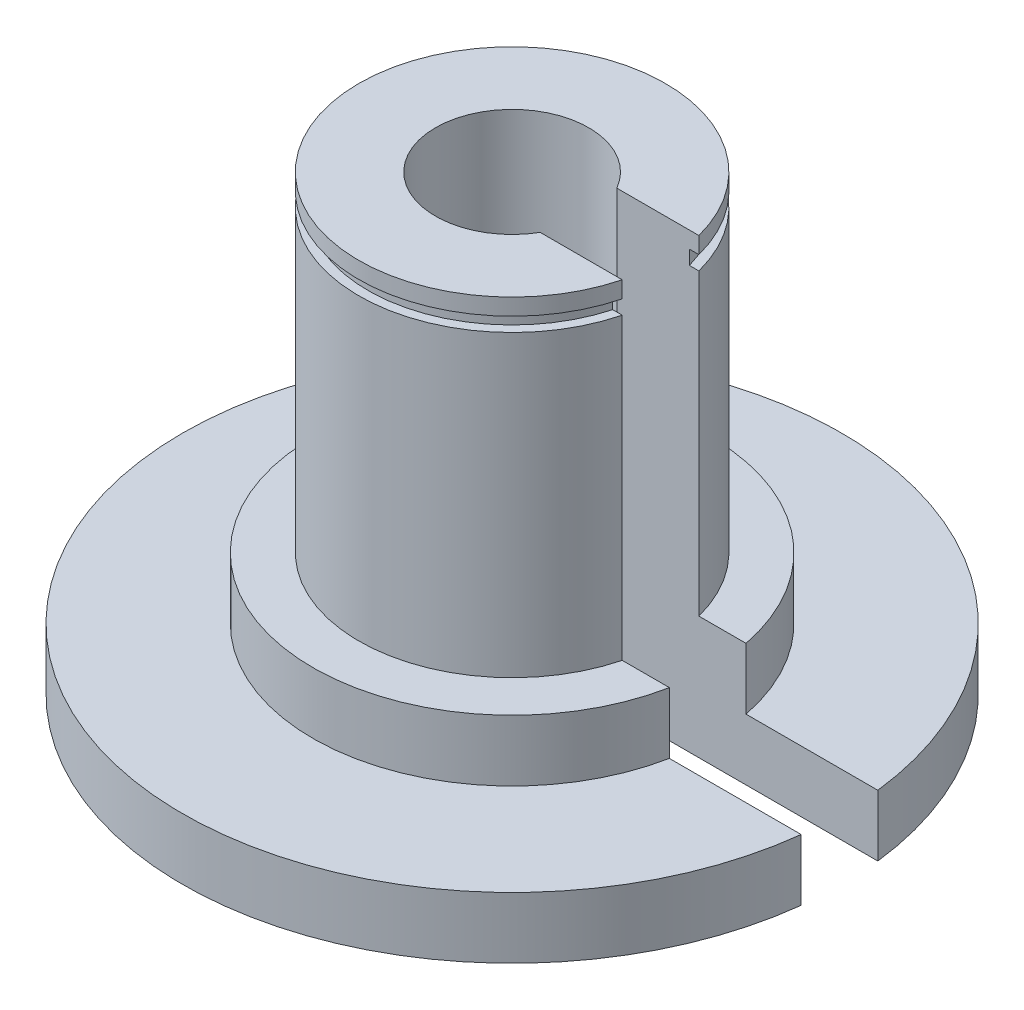
ISO-10303-21;
HEADER;
FILE_DESCRIPTION(('STEP AP214'),'2;1');
FILE_NAME('part.step','',(''),(''),'','','');
FILE_SCHEMA(('AUTOMOTIVE_DESIGN { 1 0 10303 214 1 1 1 1 }'));
ENDSEC;
DATA;
#1=APPLICATION_CONTEXT('core data for automotive mechanical design processes');
#2=APPLICATION_PROTOCOL_DEFINITION('international standard','automotive_design',2000,#1);
#3=PRODUCT_CONTEXT('',#1,'mechanical');
#4=PRODUCT('Part','Part','',(#3));
#5=PRODUCT_RELATED_PRODUCT_CATEGORY('part','',(#4));
#6=PRODUCT_DEFINITION_FORMATION('','',#4);
#7=PRODUCT_DEFINITION_CONTEXT('part definition',#1,'design');
#8=PRODUCT_DEFINITION('design','',#6,#7);
#9=PRODUCT_DEFINITION_SHAPE('','',#8);
#10=(LENGTH_UNIT() NAMED_UNIT(*) SI_UNIT(.MILLI.,.METRE.));
#11=(NAMED_UNIT(*) PLANE_ANGLE_UNIT() SI_UNIT($,.RADIAN.));
#12=(NAMED_UNIT(*) SI_UNIT($,.STERADIAN.) SOLID_ANGLE_UNIT());
#13=UNCERTAINTY_MEASURE_WITH_UNIT(LENGTH_MEASURE(1.E-05),#10,'distance_accuracy_value','');
#14=(GEOMETRIC_REPRESENTATION_CONTEXT(3) GLOBAL_UNCERTAINTY_ASSIGNED_CONTEXT((#13)) GLOBAL_UNIT_ASSIGNED_CONTEXT((#10,
#11,#12)) REPRESENTATION_CONTEXT('',''));
#15=CARTESIAN_POINT('',(0.,0.,0.));
#16=DIRECTION('',(0.,0.,1.));
#17=DIRECTION('',(1.,0.,0.));
#18=AXIS2_PLACEMENT_3D('',#15,#16,#17);
#19=CARTESIAN_POINT('',(0.,50.8,0.));
#20=DIRECTION('',(0.,-1.,0.));
#21=DIRECTION('',(0.,0.,-1.));
#22=AXIS2_PLACEMENT_3D('',#19,#20,#21);
#23=CYLINDRICAL_SURFACE('',#22,27.305);
#24=CARTESIAN_POINT('',(0.,5.08,0.));
#25=DIRECTION('',(0.,1.,0.));
#26=DIRECTION('',(0.,0.,1.));
#27=AXIS2_PLACEMENT_3D('',#24,#25,#26);
#28=CIRCLE('',#27,27.305);
#29=CARTESIAN_POINT('',(27.1197787601595,5.08,-3.175));
#30=VERTEX_POINT('',#29);
#31=CARTESIAN_POINT('',(27.1197787601595,5.08,3.175));
#32=VERTEX_POINT('',#31);
#33=EDGE_CURVE('E256',#30,#32,#28,.T.);
#34=ORIENTED_EDGE('',*,*,#33,.F.);
#35=DIRECTION('',(0.,-1.,0.));
#36=VECTOR('',#35,1.);
#37=CARTESIAN_POINT('',(27.1197787601595,50.8,-3.175));
#38=LINE('',#37,#36);
#39=CARTESIAN_POINT('',(27.1197787601595,0.,-3.175));
#40=VERTEX_POINT('',#39);
#41=EDGE_CURVE('E188',#30,#40,#38,.T.);
#42=ORIENTED_EDGE('',*,*,#41,.T.);
#43=CARTESIAN_POINT('',(0.,0.,0.));
#44=DIRECTION('',(0.,1.,0.));
#45=DIRECTION('',(0.,0.,1.));
#46=AXIS2_PLACEMENT_3D('',#43,#44,#45);
#47=CIRCLE('',#46,27.305);
#48=CARTESIAN_POINT('',(27.1197787601595,0.,3.175));
#49=VERTEX_POINT('',#48);
#50=EDGE_CURVE('E200',#40,#49,#47,.T.);
#51=ORIENTED_EDGE('',*,*,#50,.T.);
#52=DIRECTION('',(0.,-1.,0.));
#53=VECTOR('',#52,1.);
#54=CARTESIAN_POINT('',(27.1197787601595,50.8,3.175));
#55=LINE('',#54,#53);
#56=EDGE_CURVE('E192',#49,#32,#55,.F.);
#57=ORIENTED_EDGE('',*,*,#56,.T.);
#58=EDGE_LOOP('',(#34,#42,#51,#57));
#59=FACE_BOUND('',#58,.T.);
#60=ADVANCED_FACE('F37',(#59),#23,.T.);
#61=CARTESIAN_POINT('',(2.49980958537012,6.35,3.175));
#62=DIRECTION('',(0.,0.,1.));
#63=DIRECTION('',(1.,0.,0.));
#64=AXIS2_PLACEMENT_3D('',#61,#62,#63);
#65=PLANE('',#64);
#66=DIRECTION('',(-1.,0.,0.));
#67=VECTOR('',#66,1.);
#68=CARTESIAN_POINT('',(2.49980958537012,5.08,3.175));
#69=LINE('',#68,#67);
#70=CARTESIAN_POINT('',(16.2018355441598,5.08,3.175));
#71=VERTEX_POINT('',#70);
#72=EDGE_CURVE('E257',#32,#71,#69,.T.);
#73=ORIENTED_EDGE('',*,*,#72,.F.);
#74=ORIENTED_EDGE('',*,*,#56,.F.);
#75=DIRECTION('',(-1.,0.,0.));
#76=VECTOR('',#75,1.);
#77=CARTESIAN_POINT('',(2.49980958537012,0.,3.175));
#78=LINE('',#77,#76);
#79=CARTESIAN_POINT('',(3.25437345121914,0.,3.175));
#80=VERTEX_POINT('',#79);
#81=EDGE_CURVE('E59',#49,#80,#78,.T.);
#82=ORIENTED_EDGE('',*,*,#81,.T.);
#83=DIRECTION('',(0.,-1.,0.));
#84=VECTOR('',#83,1.);
#85=CARTESIAN_POINT('',(3.25437345121914,50.8,3.175));
#86=LINE('',#85,#84);
#87=CARTESIAN_POINT('',(3.25437345121914,6.35,3.175));
#88=VERTEX_POINT('',#87);
#89=EDGE_CURVE('E190',#80,#88,#86,.F.);
#90=ORIENTED_EDGE('',*,*,#89,.T.);
#91=DIRECTION('',(-1.,0.,0.));
#92=VECTOR('',#91,1.);
#93=CARTESIAN_POINT('',(2.49980958537012,6.35,3.175));
#94=LINE('',#93,#92);
#95=CARTESIAN_POINT('',(5.49926131403118,6.35,3.175));
#96=VERTEX_POINT('',#95);
#97=EDGE_CURVE('E178',#96,#88,#94,.T.);
#98=ORIENTED_EDGE('',*,*,#97,.F.);
#99=DIRECTION('',(0.,1.,0.));
#100=VECTOR('',#99,1.);
#101=CARTESIAN_POINT('',(5.49926131403119,6.35,3.175));
#102=LINE('',#101,#100);
#103=CARTESIAN_POINT('',(5.49926131403119,37.465,3.175));
#104=VERTEX_POINT('',#103);
#105=EDGE_CURVE('E249',#104,#96,#102,.F.);
#106=ORIENTED_EDGE('',*,*,#105,.F.);
#107=DIRECTION('',(-1.,0.,0.));
#108=VECTOR('',#107,1.);
#109=CARTESIAN_POINT('',(2.49980958537012,37.465,3.175));
#110=LINE('',#109,#108);
#111=CARTESIAN_POINT('',(12.2967221242085,37.465,3.175));
#112=VERTEX_POINT('',#111);
#113=EDGE_CURVE('E149',#112,#104,#110,.T.);
#114=ORIENTED_EDGE('',*,*,#113,.F.);
#115=DIRECTION('',(0.,1.,0.));
#116=VECTOR('',#115,1.);
#117=CARTESIAN_POINT('',(12.2967221242085,6.35,3.175));
#118=LINE('',#117,#116);
#119=CARTESIAN_POINT('',(12.2967221242085,36.0934,3.175));
#120=VERTEX_POINT('',#119);
#121=EDGE_CURVE('E247',#112,#120,#118,.F.);
#122=ORIENTED_EDGE('',*,*,#121,.T.);
#123=DIRECTION('',(1.,0.,0.));
#124=VECTOR('',#123,1.);
#125=CARTESIAN_POINT('',(-0.0926106199202349,36.0934,3.175));
#126=LINE('',#125,#124);
#127=CARTESIAN_POINT('',(11.5080501823723,36.0934,3.175));
#128=VERTEX_POINT('',#127);
#129=EDGE_CURVE('E244',#128,#120,#126,.T.);
#130=ORIENTED_EDGE('',*,*,#129,.F.);
#131=DIRECTION('',(0.,-1.,0.));
#132=VECTOR('',#131,1.);
#133=CARTESIAN_POINT('',(11.5080501823723,36.0934,3.175));
#134=LINE('',#133,#132);
#135=CARTESIAN_POINT('',(11.5080501823723,34.925,3.175));
#136=VERTEX_POINT('',#135);
#137=EDGE_CURVE('E241',#136,#128,#134,.F.);
#138=ORIENTED_EDGE('',*,*,#137,.F.);
#139=DIRECTION('',(1.,0.,0.));
#140=VECTOR('',#139,1.);
#141=CARTESIAN_POINT('',(-0.0926106199202349,34.925,3.175));
#142=LINE('',#141,#140);
#143=CARTESIAN_POINT('',(12.2967221242085,34.925,3.175));
#144=VERTEX_POINT('',#143);
#145=EDGE_CURVE('E239',#136,#144,#142,.T.);
#146=ORIENTED_EDGE('',*,*,#145,.T.);
#147=DIRECTION('',(0.,1.,0.));
#148=VECTOR('',#147,1.);
#149=CARTESIAN_POINT('',(12.2967221242085,6.35,3.175));
#150=LINE('',#149,#148);
#151=CARTESIAN_POINT('',(12.2967221242085,10.16,3.175));
#152=VERTEX_POINT('',#151);
#153=EDGE_CURVE('E220',#144,#152,#150,.F.);
#154=ORIENTED_EDGE('',*,*,#153,.T.);
#155=DIRECTION('',(1.,0.,0.));
#156=VECTOR('',#155,1.);
#157=CARTESIAN_POINT('',(0.,10.16,3.175));
#158=LINE('',#157,#156);
#159=CARTESIAN_POINT('',(16.2018355441598,10.16,3.175));
#160=VERTEX_POINT('',#159);
#161=EDGE_CURVE('E158',#152,#160,#158,.T.);
#162=ORIENTED_EDGE('',*,*,#161,.T.);
#163=DIRECTION('',(0.,1.,0.));
#164=VECTOR('',#163,1.);
#165=CARTESIAN_POINT('',(16.2018355441598,5.08,3.175));
#166=LINE('',#165,#164);
#167=EDGE_CURVE('E51',#71,#160,#166,.T.);
#168=ORIENTED_EDGE('',*,*,#167,.F.);
#169=EDGE_LOOP('',(#73,#74,#82,#90,#98,#106,#114,#122,#130,#138,#146,#154,#162,#168));
#170=FACE_BOUND('',#169,.T.);
#171=ADVANCED_FACE('F268',(#170),#65,.F.);
#172=CARTESIAN_POINT('',(2.49980958537012,6.35,-3.175));
#173=DIRECTION('',(0.,0.,-1.));
#174=DIRECTION('',(-1.,0.,0.));
#175=AXIS2_PLACEMENT_3D('',#172,#173,#174);
#176=PLANE('',#175);
#177=DIRECTION('',(1.,0.,0.));
#178=VECTOR('',#177,1.);
#179=CARTESIAN_POINT('',(2.49980958537012,5.08,-3.175));
#180=LINE('',#179,#178);
#181=CARTESIAN_POINT('',(16.2018355441598,5.08,-3.175));
#182=VERTEX_POINT('',#181);
#183=EDGE_CURVE('E12',#182,#30,#180,.T.);
#184=ORIENTED_EDGE('',*,*,#183,.F.);
#185=DIRECTION('',(0.,1.,0.));
#186=VECTOR('',#185,1.);
#187=CARTESIAN_POINT('',(16.2018355441598,5.08,-3.175));
#188=LINE('',#187,#186);
#189=CARTESIAN_POINT('',(16.2018355441598,10.16,-3.175));
#190=VERTEX_POINT('',#189);
#191=EDGE_CURVE('E253',#190,#182,#188,.F.);
#192=ORIENTED_EDGE('',*,*,#191,.F.);
#193=DIRECTION('',(-1.,0.,0.));
#194=VECTOR('',#193,1.);
#195=CARTESIAN_POINT('',(0.,10.16,-3.175));
#196=LINE('',#195,#194);
#197=CARTESIAN_POINT('',(12.2967221242085,10.16,-3.175));
#198=VERTEX_POINT('',#197);
#199=EDGE_CURVE('E215',#190,#198,#196,.T.);
#200=ORIENTED_EDGE('',*,*,#199,.T.);
#201=DIRECTION('',(0.,1.,0.));
#202=VECTOR('',#201,1.);
#203=CARTESIAN_POINT('',(12.2967221242085,6.35,-3.175));
#204=LINE('',#203,#202);
#205=CARTESIAN_POINT('',(12.2967221242085,34.925,-3.175));
#206=VERTEX_POINT('',#205);
#207=EDGE_CURVE('E222',#198,#206,#204,.T.);
#208=ORIENTED_EDGE('',*,*,#207,.T.);
#209=DIRECTION('',(-1.,0.,0.));
#210=VECTOR('',#209,1.);
#211=CARTESIAN_POINT('',(-0.0926106199202349,34.925,-3.175));
#212=LINE('',#211,#210);
#213=CARTESIAN_POINT('',(11.5080501823723,34.925,-3.175));
#214=VERTEX_POINT('',#213);
#215=EDGE_CURVE('E224',#206,#214,#212,.T.);
#216=ORIENTED_EDGE('',*,*,#215,.T.);
#217=DIRECTION('',(0.,-1.,0.));
#218=VECTOR('',#217,1.);
#219=CARTESIAN_POINT('',(11.5080501823723,36.0934,-3.175));
#220=LINE('',#219,#218);
#221=CARTESIAN_POINT('',(11.5080501823723,36.0934,-3.175));
#222=VERTEX_POINT('',#221);
#223=EDGE_CURVE('E226',#222,#214,#220,.T.);
#224=ORIENTED_EDGE('',*,*,#223,.F.);
#225=DIRECTION('',(-1.,0.,0.));
#226=VECTOR('',#225,1.);
#227=CARTESIAN_POINT('',(-0.0926106199202349,36.0934,-3.175));
#228=LINE('',#227,#226);
#229=CARTESIAN_POINT('',(12.2967221242085,36.0934,-3.175));
#230=VERTEX_POINT('',#229);
#231=EDGE_CURVE('E233',#230,#222,#228,.T.);
#232=ORIENTED_EDGE('',*,*,#231,.F.);
#233=DIRECTION('',(0.,1.,0.));
#234=VECTOR('',#233,1.);
#235=CARTESIAN_POINT('',(12.2967221242085,6.35,-3.175));
#236=LINE('',#235,#234);
#237=CARTESIAN_POINT('',(12.2967221242085,37.465,-3.175));
#238=VERTEX_POINT('',#237);
#239=EDGE_CURVE('E144',#230,#238,#236,.T.);
#240=ORIENTED_EDGE('',*,*,#239,.T.);
#241=DIRECTION('',(1.,0.,0.));
#242=VECTOR('',#241,1.);
#243=CARTESIAN_POINT('',(2.49980958537012,37.465,-3.175));
#244=LINE('',#243,#242);
#245=CARTESIAN_POINT('',(5.49926131403118,37.465,-3.175));
#246=VERTEX_POINT('',#245);
#247=EDGE_CURVE('E137',#246,#238,#244,.T.);
#248=ORIENTED_EDGE('',*,*,#247,.F.);
#249=DIRECTION('',(0.,1.,0.));
#250=VECTOR('',#249,1.);
#251=CARTESIAN_POINT('',(5.49926131403118,6.35,-3.175));
#252=LINE('',#251,#250);
#253=CARTESIAN_POINT('',(5.49926131403118,6.35,-3.175));
#254=VERTEX_POINT('',#253);
#255=EDGE_CURVE('E141',#254,#246,#252,.T.);
#256=ORIENTED_EDGE('',*,*,#255,.F.);
#257=DIRECTION('',(1.,0.,0.));
#258=VECTOR('',#257,1.);
#259=CARTESIAN_POINT('',(2.49980958537012,6.35,-3.175));
#260=LINE('',#259,#258);
#261=CARTESIAN_POINT('',(3.25437345121914,6.35,-3.175));
#262=VERTEX_POINT('',#261);
#263=EDGE_CURVE('E176',#262,#254,#260,.T.);
#264=ORIENTED_EDGE('',*,*,#263,.F.);
#265=DIRECTION('',(0.,-1.,0.));
#266=VECTOR('',#265,1.);
#267=CARTESIAN_POINT('',(3.25437345121914,50.8,-3.175));
#268=LINE('',#267,#266);
#269=CARTESIAN_POINT('',(3.25437345121914,0.,-3.175));
#270=VERTEX_POINT('',#269);
#271=EDGE_CURVE('E181',#262,#270,#268,.T.);
#272=ORIENTED_EDGE('',*,*,#271,.T.);
#273=DIRECTION('',(1.,0.,0.));
#274=VECTOR('',#273,1.);
#275=CARTESIAN_POINT('',(2.49980958537012,0.,-3.175));
#276=LINE('',#275,#274);
#277=EDGE_CURVE('E182',#270,#40,#276,.T.);
#278=ORIENTED_EDGE('',*,*,#277,.T.);
#279=ORIENTED_EDGE('',*,*,#41,.F.);
#280=EDGE_LOOP('',(#184,#192,#200,#208,#216,#224,#232,#240,#248,#256,#264,#272,#278,#279));
#281=FACE_BOUND('',#280,.T.);
#282=ADVANCED_FACE('F140',(#281),#176,.F.);
#283=CARTESIAN_POINT('',(0.,6.35,0.));
#284=DIRECTION('',(0.,1.,0.));
#285=DIRECTION('',(0.,0.,1.));
#286=AXIS2_PLACEMENT_3D('',#283,#284,#285);
#287=CYLINDRICAL_SURFACE('',#286,6.35);
#288=CARTESIAN_POINT('',(0.,37.465,0.));
#289=DIRECTION('',(0.,1.,0.));
#290=DIRECTION('',(0.,0.,1.));
#291=AXIS2_PLACEMENT_3D('',#288,#289,#290);
#292=CIRCLE('',#291,6.35);
#293=EDGE_CURVE('E155',#104,#246,#292,.F.);
#294=ORIENTED_EDGE('',*,*,#293,.F.);
#295=ORIENTED_EDGE('',*,*,#105,.T.);
#296=CARTESIAN_POINT('',(0.,6.35,0.));
#297=DIRECTION('',(0.,1.,0.));
#298=DIRECTION('',(0.,0.,1.));
#299=AXIS2_PLACEMENT_3D('',#296,#297,#298);
#300=CIRCLE('',#299,6.35);
#301=EDGE_CURVE('E157',#254,#96,#300,.T.);
#302=ORIENTED_EDGE('',*,*,#301,.F.);
#303=ORIENTED_EDGE('',*,*,#255,.T.);
#304=EDGE_LOOP('',(#294,#295,#302,#303));
#305=FACE_BOUND('',#304,.T.);
#306=ADVANCED_FACE('F154',(#305),#287,.F.);
#307=CARTESIAN_POINT('',(0.,6.35,0.));
#308=DIRECTION('',(0.,1.,0.));
#309=DIRECTION('',(0.,0.,1.));
#310=AXIS2_PLACEMENT_3D('',#307,#308,#309);
#311=CYLINDRICAL_SURFACE('',#310,12.7);
#312=ORIENTED_EDGE('',*,*,#121,.F.);
#313=CARTESIAN_POINT('',(0.,37.465,0.));
#314=DIRECTION('',(0.,1.,0.));
#315=DIRECTION('',(0.,0.,1.));
#316=AXIS2_PLACEMENT_3D('',#313,#314,#315);
#317=CIRCLE('',#316,12.7);
#318=EDGE_CURVE('E163',#112,#238,#317,.F.);
#319=ORIENTED_EDGE('',*,*,#318,.T.);
#320=ORIENTED_EDGE('',*,*,#239,.F.);
#321=CARTESIAN_POINT('',(0.,36.0934,0.));
#322=DIRECTION('',(0.,1.,0.));
#323=DIRECTION('',(0.,0.,1.));
#324=AXIS2_PLACEMENT_3D('',#321,#322,#323);
#325=CIRCLE('',#324,12.7);
#326=EDGE_CURVE('E185',#120,#230,#325,.F.);
#327=ORIENTED_EDGE('',*,*,#326,.F.);
#328=EDGE_LOOP('',(#312,#319,#320,#327));
#329=FACE_BOUND('',#328,.T.);
#330=ADVANCED_FACE('F281',(#329),#311,.T.);
#331=ORIENTED_EDGE('',*,*,#153,.F.);
#332=CARTESIAN_POINT('',(0.,34.925,0.));
#333=DIRECTION('',(0.,1.,0.));
#334=DIRECTION('',(0.,0.,1.));
#335=AXIS2_PLACEMENT_3D('',#332,#333,#334);
#336=CIRCLE('',#335,12.7);
#337=EDGE_CURVE('E174',#144,#206,#336,.F.);
#338=ORIENTED_EDGE('',*,*,#337,.T.);
#339=ORIENTED_EDGE('',*,*,#207,.F.);
#340=CARTESIAN_POINT('',(0.,10.16,0.));
#341=DIRECTION('',(0.,1.,0.));
#342=DIRECTION('',(0.,0.,1.));
#343=AXIS2_PLACEMENT_3D('',#340,#341,#342);
#344=CIRCLE('',#343,12.7);
#345=EDGE_CURVE('E44',#152,#198,#344,.F.);
#346=ORIENTED_EDGE('',*,*,#345,.F.);
#347=EDGE_LOOP('',(#331,#338,#339,#346));
#348=FACE_BOUND('',#347,.T.);
#349=ADVANCED_FACE('F219',(#348),#311,.T.);
#350=CARTESIAN_POINT('',(0.,50.8,0.));
#351=DIRECTION('',(0.,-1.,0.));
#352=DIRECTION('',(0.,0.,-1.));
#353=AXIS2_PLACEMENT_3D('',#350,#351,#352);
#354=CYLINDRICAL_SURFACE('',#353,4.5466);
#355=ORIENTED_EDGE('',*,*,#89,.F.);
#356=CARTESIAN_POINT('',(0.,0.,0.));
#357=DIRECTION('',(0.,1.,0.));
#358=DIRECTION('',(0.,0.,1.));
#359=AXIS2_PLACEMENT_3D('',#356,#357,#358);
#360=CIRCLE('',#359,4.5466);
#361=EDGE_CURVE('E197',#270,#80,#360,.T.);
#362=ORIENTED_EDGE('',*,*,#361,.F.);
#363=ORIENTED_EDGE('',*,*,#271,.F.);
#364=CARTESIAN_POINT('',(0.,6.35,0.));
#365=DIRECTION('',(0.,1.,0.));
#366=DIRECTION('',(0.,0.,1.));
#367=AXIS2_PLACEMENT_3D('',#364,#365,#366);
#368=CIRCLE('',#367,4.5466);
#369=EDGE_CURVE('E196',#262,#88,#368,.T.);
#370=ORIENTED_EDGE('',*,*,#369,.T.);
#371=EDGE_LOOP('',(#355,#362,#363,#370));
#372=FACE_BOUND('',#371,.T.);
#373=ADVANCED_FACE('F289',(#372),#354,.F.);
#374=CARTESIAN_POINT('',(0.,0.,0.));
#375=DIRECTION('',(0.,1.,0.));
#376=DIRECTION('',(0.,0.,1.));
#377=AXIS2_PLACEMENT_3D('',#374,#375,#376);
#378=PLANE('',#377);
#379=ORIENTED_EDGE('',*,*,#361,.T.);
#380=ORIENTED_EDGE('',*,*,#81,.F.);
#381=ORIENTED_EDGE('',*,*,#50,.F.);
#382=ORIENTED_EDGE('',*,*,#277,.F.);
#383=EDGE_LOOP('',(#379,#380,#381,#382));
#384=FACE_BOUND('',#383,.T.);
#385=ADVANCED_FACE('F291',(#384),#378,.F.);
#386=CARTESIAN_POINT('',(0.,6.35,0.));
#387=DIRECTION('',(0.,1.,0.));
#388=DIRECTION('',(0.,0.,1.));
#389=AXIS2_PLACEMENT_3D('',#386,#387,#388);
#390=PLANE('',#389);
#391=ORIENTED_EDGE('',*,*,#97,.T.);
#392=ORIENTED_EDGE('',*,*,#369,.F.);
#393=ORIENTED_EDGE('',*,*,#263,.T.);
#394=ORIENTED_EDGE('',*,*,#301,.T.);
#395=EDGE_LOOP('',(#391,#392,#393,#394));
#396=FACE_BOUND('',#395,.T.);
#397=ADVANCED_FACE('F285',(#396),#390,.T.);
#398=CARTESIAN_POINT('',(-0.0926106199202349,36.0934,0.));
#399=DIRECTION('',(0.,1.,0.));
#400=DIRECTION('',(0.,0.,1.));
#401=AXIS2_PLACEMENT_3D('',#398,#399,#400);
#402=PLANE('',#401);
#403=CARTESIAN_POINT('',(0.,36.0934,0.));
#404=DIRECTION('',(0.,1.,0.));
#405=DIRECTION('',(0.,0.,1.));
#406=AXIS2_PLACEMENT_3D('',#403,#404,#405);
#407=CIRCLE('',#406,11.938);
#408=EDGE_CURVE('E166',#222,#128,#407,.T.);
#409=ORIENTED_EDGE('',*,*,#408,.T.);
#410=ORIENTED_EDGE('',*,*,#129,.T.);
#411=ORIENTED_EDGE('',*,*,#326,.T.);
#412=ORIENTED_EDGE('',*,*,#231,.T.);
#413=EDGE_LOOP('',(#409,#410,#411,#412));
#414=FACE_BOUND('',#413,.T.);
#415=ADVANCED_FACE('F277',(#414),#402,.F.);
#416=CARTESIAN_POINT('',(-0.0926106199202349,34.925,0.));
#417=DIRECTION('',(0.,1.,0.));
#418=DIRECTION('',(0.,0.,1.));
#419=AXIS2_PLACEMENT_3D('',#416,#417,#418);
#420=PLANE('',#419);
#421=ORIENTED_EDGE('',*,*,#145,.F.);
#422=CARTESIAN_POINT('',(0.,34.925,0.));
#423=DIRECTION('',(0.,1.,0.));
#424=DIRECTION('',(0.,0.,1.));
#425=AXIS2_PLACEMENT_3D('',#422,#423,#424);
#426=CIRCLE('',#425,11.938);
#427=EDGE_CURVE('E162',#214,#136,#426,.T.);
#428=ORIENTED_EDGE('',*,*,#427,.F.);
#429=ORIENTED_EDGE('',*,*,#215,.F.);
#430=ORIENTED_EDGE('',*,*,#337,.F.);
#431=EDGE_LOOP('',(#421,#428,#429,#430));
#432=FACE_BOUND('',#431,.T.);
#433=ADVANCED_FACE('F272',(#432),#420,.T.);
#434=CARTESIAN_POINT('',(0.,36.0934,0.));
#435=DIRECTION('',(0.,-1.,0.));
#436=DIRECTION('',(0.,0.,-1.));
#437=AXIS2_PLACEMENT_3D('',#434,#435,#436);
#438=CYLINDRICAL_SURFACE('',#437,11.938);
#439=ORIENTED_EDGE('',*,*,#427,.T.);
#440=ORIENTED_EDGE('',*,*,#137,.T.);
#441=ORIENTED_EDGE('',*,*,#408,.F.);
#442=ORIENTED_EDGE('',*,*,#223,.T.);
#443=EDGE_LOOP('',(#439,#440,#441,#442));
#444=FACE_BOUND('',#443,.T.);
#445=ADVANCED_FACE('F274',(#444),#438,.T.);
#446=CARTESIAN_POINT('',(0.,37.465,0.));
#447=DIRECTION('',(0.,1.,0.));
#448=DIRECTION('',(0.,0.,1.));
#449=AXIS2_PLACEMENT_3D('',#446,#447,#448);
#450=PLANE('',#449);
#451=ORIENTED_EDGE('',*,*,#113,.T.);
#452=ORIENTED_EDGE('',*,*,#293,.T.);
#453=ORIENTED_EDGE('',*,*,#247,.T.);
#454=ORIENTED_EDGE('',*,*,#318,.F.);
#455=EDGE_LOOP('',(#451,#452,#453,#454));
#456=FACE_BOUND('',#455,.T.);
#457=ADVANCED_FACE('F161',(#456),#450,.T.);
#458=CARTESIAN_POINT('',(0.,10.16,0.));
#459=DIRECTION('',(0.,1.,0.));
#460=DIRECTION('',(0.,0.,1.));
#461=AXIS2_PLACEMENT_3D('',#458,#459,#460);
#462=PLANE('',#461);
#463=ORIENTED_EDGE('',*,*,#161,.F.);
#464=ORIENTED_EDGE('',*,*,#345,.T.);
#465=ORIENTED_EDGE('',*,*,#199,.F.);
#466=CARTESIAN_POINT('',(0.,10.16,0.));
#467=DIRECTION('',(0.,1.,0.));
#468=DIRECTION('',(0.,0.,1.));
#469=AXIS2_PLACEMENT_3D('',#466,#467,#468);
#470=CIRCLE('',#469,16.51);
#471=EDGE_CURVE('E168',#190,#160,#470,.T.);
#472=ORIENTED_EDGE('',*,*,#471,.T.);
#473=EDGE_LOOP('',(#463,#464,#465,#472));
#474=FACE_BOUND('',#473,.T.);
#475=ADVANCED_FACE('F213',(#474),#462,.T.);
#476=CARTESIAN_POINT('',(0.,10.16,0.));
#477=DIRECTION('',(0.,-1.,0.));
#478=DIRECTION('',(0.,0.,-1.));
#479=AXIS2_PLACEMENT_3D('',#476,#477,#478);
#480=CYLINDRICAL_SURFACE('',#479,16.51);
#481=ORIENTED_EDGE('',*,*,#167,.T.);
#482=ORIENTED_EDGE('',*,*,#471,.F.);
#483=ORIENTED_EDGE('',*,*,#191,.T.);
#484=CARTESIAN_POINT('',(0.,5.08,0.));
#485=DIRECTION('',(0.,1.,0.));
#486=DIRECTION('',(0.,0.,1.));
#487=AXIS2_PLACEMENT_3D('',#484,#485,#486);
#488=CIRCLE('',#487,16.51);
#489=EDGE_CURVE('E251',#182,#71,#488,.T.);
#490=ORIENTED_EDGE('',*,*,#489,.T.);
#491=EDGE_LOOP('',(#481,#482,#483,#490));
#492=FACE_BOUND('',#491,.T.);
#493=ADVANCED_FACE('F261',(#492),#480,.T.);
#494=CARTESIAN_POINT('',(-0.0926106199202349,5.08,0.));
#495=DIRECTION('',(0.,1.,0.));
#496=DIRECTION('',(0.,0.,1.));
#497=AXIS2_PLACEMENT_3D('',#494,#495,#496);
#498=PLANE('',#497);
#499=ORIENTED_EDGE('',*,*,#72,.T.);
#500=ORIENTED_EDGE('',*,*,#489,.F.);
#501=ORIENTED_EDGE('',*,*,#183,.T.);
#502=ORIENTED_EDGE('',*,*,#33,.T.);
#503=EDGE_LOOP('',(#499,#500,#501,#502));
#504=FACE_BOUND('',#503,.T.);
#505=ADVANCED_FACE('F262',(#504),#498,.T.);
#506=CLOSED_SHELL('',(#60,#171,#282,#306,#330,#349,#373,#385,#397,#415,#433,#445,#457,#475,#493,#505));
#507=MANIFOLD_SOLID_BREP('B2',#506);
#508=ADVANCED_BREP_SHAPE_REPRESENTATION('',(#18,#507),#14);
#509=SHAPE_DEFINITION_REPRESENTATION(#9,#508);
ENDSEC;
END-ISO-10303-21;
